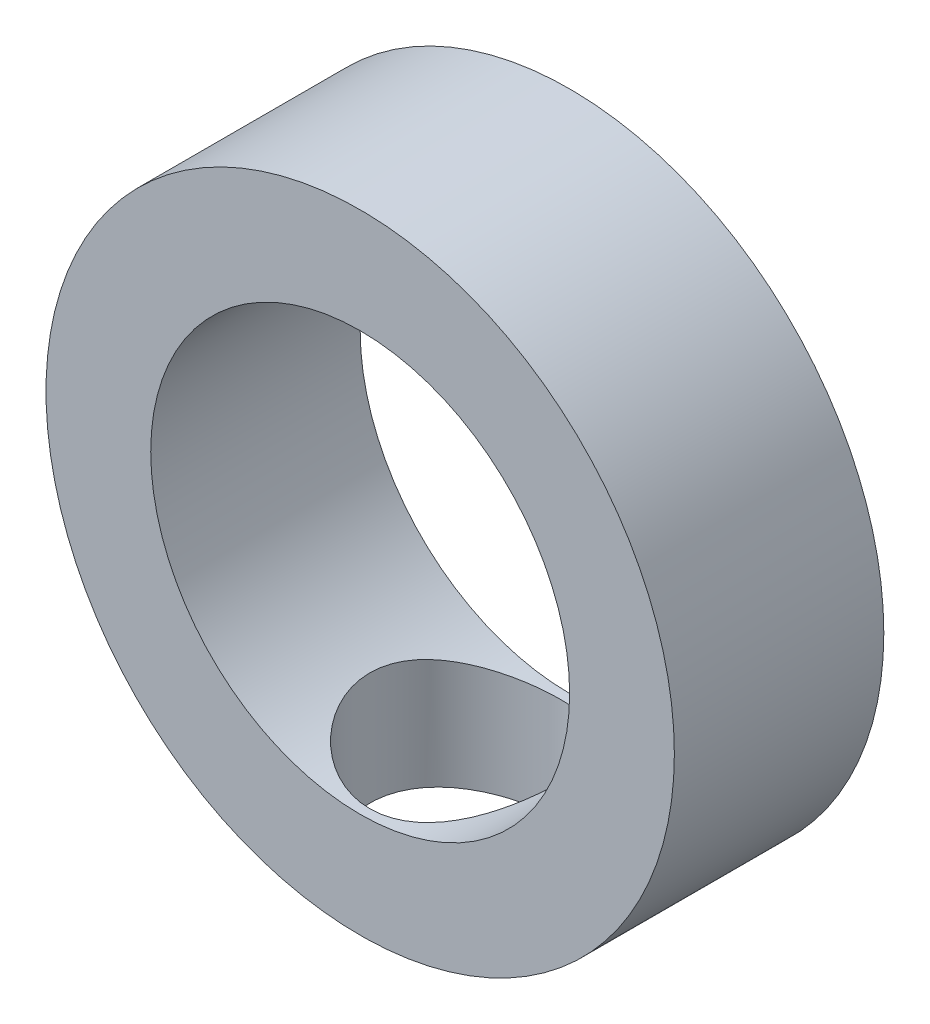
ISO-10303-21;
HEADER;
FILE_DESCRIPTION(('STEP AP214'),'2;1');
FILE_NAME('part.step','',(''),(''),'','','');
FILE_SCHEMA(('AUTOMOTIVE_DESIGN { 1 0 10303 214 1 1 1 1 }'));
ENDSEC;
DATA;
#1=APPLICATION_CONTEXT('core data for automotive mechanical design processes');
#2=APPLICATION_PROTOCOL_DEFINITION('international standard','automotive_design',2000,#1);
#3=PRODUCT_CONTEXT('',#1,'mechanical');
#4=PRODUCT('Part','Part','',(#3));
#5=PRODUCT_RELATED_PRODUCT_CATEGORY('part','',(#4));
#6=PRODUCT_DEFINITION_FORMATION('','',#4);
#7=PRODUCT_DEFINITION_CONTEXT('part definition',#1,'design');
#8=PRODUCT_DEFINITION('design','',#6,#7);
#9=PRODUCT_DEFINITION_SHAPE('','',#8);
#10=(LENGTH_UNIT() NAMED_UNIT(*) SI_UNIT(.MILLI.,.METRE.));
#11=(NAMED_UNIT(*) PLANE_ANGLE_UNIT() SI_UNIT($,.RADIAN.));
#12=(NAMED_UNIT(*) SI_UNIT($,.STERADIAN.) SOLID_ANGLE_UNIT());
#13=UNCERTAINTY_MEASURE_WITH_UNIT(LENGTH_MEASURE(1.E-05),#10,'distance_accuracy_value','');
#14=(GEOMETRIC_REPRESENTATION_CONTEXT(3) GLOBAL_UNCERTAINTY_ASSIGNED_CONTEXT((#13)) GLOBAL_UNIT_ASSIGNED_CONTEXT((#10,
#11,#12)) REPRESENTATION_CONTEXT('',''));
#15=CARTESIAN_POINT('',(0.,0.,0.));
#16=DIRECTION('',(0.,0.,1.));
#17=DIRECTION('',(1.,0.,0.));
#18=AXIS2_PLACEMENT_3D('',#15,#16,#17);
#19=CARTESIAN_POINT('',(0.,0.,2.5));
#20=DIRECTION('',(0.,0.,1.));
#21=DIRECTION('',(1.,0.,0.));
#22=AXIS2_PLACEMENT_3D('',#19,#20,#21);
#23=PLANE('',#22);
#24=CARTESIAN_POINT('',(0.,0.,2.5));
#25=DIRECTION('',(0.,0.,1.));
#26=DIRECTION('',(1.,0.,0.));
#27=AXIS2_PLACEMENT_3D('',#24,#25,#26);
#28=CIRCLE('',#27,7.5);
#29=CARTESIAN_POINT('',(7.5,0.,2.5));
#30=VERTEX_POINT('',#29);
#31=EDGE_CURVE('E10',#30,#30,#28,.T.);
#32=ORIENTED_EDGE('',*,*,#31,.T.);
#33=EDGE_LOOP('',(#32));
#34=FACE_BOUND('',#33,.T.);
#35=CARTESIAN_POINT('',(0.,0.,2.5));
#36=DIRECTION('',(0.,0.,1.));
#37=DIRECTION('',(1.,0.,0.));
#38=AXIS2_PLACEMENT_3D('',#35,#36,#37);
#39=CIRCLE('',#38,5.);
#40=CARTESIAN_POINT('',(5.,0.,2.5));
#41=VERTEX_POINT('',#40);
#42=EDGE_CURVE('E49',#41,#41,#39,.T.);
#43=ORIENTED_EDGE('',*,*,#42,.F.);
#44=EDGE_LOOP('',(#43));
#45=FACE_BOUND('',#44,.T.);
#46=ADVANCED_FACE('F31',(#34,#45),#23,.T.);
#47=CARTESIAN_POINT('',(0.,0.,-2.5));
#48=DIRECTION('',(0.,0.,1.));
#49=DIRECTION('',(1.,0.,0.));
#50=AXIS2_PLACEMENT_3D('',#47,#48,#49);
#51=PLANE('',#50);
#52=CARTESIAN_POINT('',(0.,0.,-2.5));
#53=DIRECTION('',(0.,0.,1.));
#54=DIRECTION('',(1.,0.,0.));
#55=AXIS2_PLACEMENT_3D('',#52,#53,#54);
#56=CIRCLE('',#55,7.5);
#57=CARTESIAN_POINT('',(7.5,0.,-2.5));
#58=VERTEX_POINT('',#57);
#59=EDGE_CURVE('E44',#58,#58,#56,.T.);
#60=ORIENTED_EDGE('',*,*,#59,.F.);
#61=EDGE_LOOP('',(#60));
#62=FACE_BOUND('',#61,.T.);
#63=CARTESIAN_POINT('',(0.,0.,-2.5));
#64=DIRECTION('',(0.,0.,1.));
#65=DIRECTION('',(1.,0.,0.));
#66=AXIS2_PLACEMENT_3D('',#63,#64,#65);
#67=CIRCLE('',#66,5.);
#68=CARTESIAN_POINT('',(5.,0.,-2.5));
#69=VERTEX_POINT('',#68);
#70=EDGE_CURVE('E51',#69,#69,#67,.T.);
#71=ORIENTED_EDGE('',*,*,#70,.T.);
#72=EDGE_LOOP('',(#71));
#73=FACE_BOUND('',#72,.T.);
#74=ADVANCED_FACE('F71',(#62,#73),#51,.F.);
#75=CARTESIAN_POINT('',(0.,0.,2.5));
#76=DIRECTION('',(0.,0.,-1.));
#77=DIRECTION('',(-1.,0.,0.));
#78=AXIS2_PLACEMENT_3D('',#75,#76,#77);
#79=CYLINDRICAL_SURFACE('',#78,7.5);
#80=CARTESIAN_POINT('',(0.,-7.5,2.26811205778749));
#81=CARTESIAN_POINT('',(0.124380004930475,-7.49999901041515,2.26811067724368));
#82=CARTESIAN_POINT('',(0.248773988035692,-7.49687641640472,2.25784694602173));
#83=CARTESIAN_POINT('',(0.493936565164761,-7.48472500152446,2.21716258089404));
#84=CARTESIAN_POINT('',(0.614704117592835,-7.47569450041953,2.18673621261265));
#85=CARTESIAN_POINT('',(0.849042458789456,-7.45271619716183,2.10683749830382));
#86=CARTESIAN_POINT('',(0.96262367334206,-7.43877572066525,2.05739351639013));
#87=CARTESIAN_POINT('',(1.17988336839848,-7.40742458721708,1.94098025364479));
#88=CARTESIAN_POINT('',(1.28356048160727,-7.39001345215039,1.87400855781128));
#89=CARTESIAN_POINT('',(1.48108880580503,-7.35300936013908,1.72238601435286));
#90=CARTESIAN_POINT('',(1.57461087456282,-7.33337114664256,1.63731744793528));
#91=CARTESIAN_POINT('',(1.74630252915413,-7.29439471733739,1.45280607597676));
#92=CARTESIAN_POINT('',(1.82446948063728,-7.27505655352901,1.35336080901573));
#93=CARTESIAN_POINT('',(1.96497407505311,-7.23838965945228,1.14012166510255));
#94=CARTESIAN_POINT('',(2.02690817858401,-7.22111709479673,1.02605132646176));
#95=CARTESIAN_POINT('',(2.13057959645331,-7.19121427167133,0.788507747324202));
#96=CARTESIAN_POINT('',(2.17232184955576,-7.17858287819029,0.665036814697097));
#97=CARTESIAN_POINT('',(2.23323445042042,-7.15986452542452,0.415896412290484));
#98=CARTESIAN_POINT('',(2.25301231936997,-7.15360184986758,0.290389034587983));
#99=CARTESIAN_POINT('',(2.27133196490298,-7.14780747904947,0.0376933151395118));
#100=CARTESIAN_POINT('',(2.26987898075043,-7.14827412315366,-0.0894946041490266));
#101=CARTESIAN_POINT('',(2.24625496268578,-7.15573005300162,-0.336984528794339));
#102=CARTESIAN_POINT('',(2.22484716131555,-7.16247903862855,-0.457367830218175));
#103=CARTESIAN_POINT('',(2.16315515797057,-7.18135014603121,-0.69274732642497));
#104=CARTESIAN_POINT('',(2.12286906588669,-7.19347280581679,-0.807742980524096));
#105=CARTESIAN_POINT('',(2.0240063132028,-7.221915662231,-1.03094044728983));
#106=CARTESIAN_POINT('',(1.96518362275285,-7.23829176676192,-1.13902585467056));
#107=CARTESIAN_POINT('',(1.83108840845483,-7.27336970468524,-1.34404641483145));
#108=CARTESIAN_POINT('',(1.75581184280405,-7.29207210903293,-1.4409788189927));
#109=CARTESIAN_POINT('',(1.58716377684879,-7.33066790777966,-1.62526805548175));
#110=CARTESIAN_POINT('',(1.4931595242417,-7.35057814873072,-1.71204332014049));
#111=CARTESIAN_POINT('',(1.29168534337727,-7.38864296578136,-1.86873428955071));
#112=CARTESIAN_POINT('',(1.18421454069327,-7.40679742773677,-1.93864889862231));
#113=CARTESIAN_POINT('',(0.957788848566871,-7.4394755675919,-2.05999479660368));
#114=CARTESIAN_POINT('',(0.838759836457604,-7.45397332907636,-2.1112952236166));
#115=CARTESIAN_POINT('',(0.593222840554135,-7.4775177428404,-2.192976473881));
#116=CARTESIAN_POINT('',(0.466716988939652,-7.48656594102085,-2.2233632301521));
#117=CARTESIAN_POINT('',(0.214759954891069,-7.49794642226515,-2.26138208118701));
#118=CARTESIAN_POINT('',(0.0894380037513087,-7.50051118063919,-2.26980219965653));
#119=CARTESIAN_POINT('',(-0.160837338140375,-7.49931888962388,-2.26585997504231));
#120=CARTESIAN_POINT('',(-0.28579077665686,-7.495562699165,-2.25350045562723));
#121=CARTESIAN_POINT('',(-0.528795427503979,-7.48230285508875,-2.20898612528323));
#122=CARTESIAN_POINT('',(-0.646939304213192,-7.47293344970557,-2.17729338349871));
#123=CARTESIAN_POINT('',(-0.87620560810731,-7.44953382554522,-2.09556968522993));
#124=CARTESIAN_POINT('',(-0.987327184558507,-7.43550304333762,-2.04553651182346));
#125=CARTESIAN_POINT('',(-1.20228139193923,-7.40382379716507,-1.92723980070054));
#126=CARTESIAN_POINT('',(-1.30588286893159,-7.38609842216896,-1.85857739071457));
#127=CARTESIAN_POINT('',(-1.50036084927829,-7.3490634773041,-1.70545479552696));
#128=CARTESIAN_POINT('',(-1.59123410226022,-7.32975350477021,-1.62099058787791));
#129=CARTESIAN_POINT('',(-1.76115659406094,-7.29083087061121,-1.43495875975379));
#130=CARTESIAN_POINT('',(-1.8396449727815,-7.2712333821074,-1.33287454988676));
#131=CARTESIAN_POINT('',(-1.97841849502096,-7.23470992945721,-1.11655815641791));
#132=CARTESIAN_POINT('',(-2.03870408351226,-7.21778390001109,-1.00232626986184));
#133=CARTESIAN_POINT('',(-2.13895472993321,-7.18871347911231,-0.765298256728712));
#134=CARTESIAN_POINT('',(-2.17901170352837,-7.17654751654314,-0.642543805101654));
#135=CARTESIAN_POINT('',(-2.23776177839687,-7.15844854192437,-0.391594118406677));
#136=CARTESIAN_POINT('',(-2.25646235213197,-7.15251334982851,-0.263400802653861));
#137=CARTESIAN_POINT('',(-2.27145524289557,-7.14776506684136,-0.0110457429445238));
#138=CARTESIAN_POINT('',(-2.26866293174287,-7.14866102464341,0.113056846033232));
#139=CARTESIAN_POINT('',(-2.24293902487034,-7.1567731800712,0.358935751266633));
#140=CARTESIAN_POINT('',(-2.22000826013822,-7.163989116911,0.480712163297166));
#141=CARTESIAN_POINT('',(-2.15525351786625,-7.18373143304585,0.716958875505766));
#142=CARTESIAN_POINT('',(-2.11367563158447,-7.1961885150466,0.831502849743113));
#143=CARTESIAN_POINT('',(-2.01299885127201,-7.22499582323834,1.05208068755578));
#144=CARTESIAN_POINT('',(-1.95389656223947,-7.24134680367319,1.1581128970847));
#145=CARTESIAN_POINT('',(-1.81729228041191,-7.27685350609402,1.36289560143759));
#146=CARTESIAN_POINT('',(-1.73919116790206,-7.29609053277952,1.46123233209248));
#147=CARTESIAN_POINT('',(-1.56788001142981,-7.33481101867799,1.64370074998133));
#148=CARTESIAN_POINT('',(-1.47466602499489,-7.35429454096783,1.72782871887339));
#149=CARTESIAN_POINT('',(-1.27242181997593,-7.39201064328956,1.88199833367906));
#150=CARTESIAN_POINT('',(-1.16300229570764,-7.41018846426812,1.95154408253592));
#151=CARTESIAN_POINT('',(-0.933474145925214,-7.44258186884047,2.07115597717286));
#152=CARTESIAN_POINT('',(-0.813370400840756,-7.45679924938096,2.12123096140118));
#153=CARTESIAN_POINT('',(-0.578646206696805,-7.47847612901315,2.19615202850127));
#154=CARTESIAN_POINT('',(-0.464732067111516,-7.48648024200108,2.22306304482311));
#155=CARTESIAN_POINT('',(-0.233882385716434,-7.49724218767874,2.25904216086376));
#156=CARTESIAN_POINT('',(-0.116947371603063,-7.50000093044978,2.26811335583351));
#157=CARTESIAN_POINT('',(0.,-7.5,2.26811205778749));
#158=B_SPLINE_CURVE_WITH_KNOTS('',3,(#80,#81,#82,#83,#84,#85,#86,#87,#88,#89,#90,#91,#92,#93,
#94,#95,#96,#97,#98,#99,#100,#101,#102,#103,#104,#105,#106,#107,#108,#109,#110,#111,#112,#113,
#114,#115,#116,#117,#118,#119,#120,#121,#122,#123,#124,#125,#126,#127,#128,#129,#130,#131,#132,
#133,#134,#135,#136,#137,#138,#139,#140,#141,#142,#143,#144,#145,#146,#147,#148,#149,#150,#151,
#152,#153,#154,#155,#156,#157),.UNSPECIFIED.,.T.,.F.,(4,2,2,2,2,2,2,2,2,2,2,2,2,2,2,2,2,2,2,2,2,
2,2,2,2,2,2,2,2,2,2,2,2,2,2,2,2,2,4),(0.,0.372710386147254,0.745526818896941,1.11778935156368,
1.49010320229913,1.87218473856597,2.25433176826009,2.64523108137395,3.03603473525739,
3.41573672715576,3.79534501931647,4.16100486013798,4.52670131893121,4.89747189943944,
5.26833366023471,5.65494708758687,6.04158563202136,6.43089194967331,6.82008777906267,
7.1951165910828,7.57009444593396,7.936443404555,8.30283666066691,8.67779609208548,
9.05285110199032,9.44176223581698,9.83066386183024,10.2177821108498,10.6047648682387,
10.9753603544638,11.3459405492557,11.7117677841261,12.0776659370493,12.4570825446928,
12.8365982898995,13.2274517231063,13.6181275268197,13.9686265042653,14.3190646639474),.UNSPECIFIED.);
#159=CARTESIAN_POINT('',(0.,-7.5,2.26811205778749));
#160=VERTEX_POINT('',#159);
#161=EDGE_CURVE('E54',#160,#160,#158,.T.);
#162=ORIENTED_EDGE('',*,*,#161,.T.);
#163=EDGE_LOOP('',(#162));
#164=FACE_BOUND('',#163,.T.);
#165=ORIENTED_EDGE('',*,*,#31,.F.);
#166=EDGE_LOOP('',(#165));
#167=FACE_BOUND('',#166,.T.);
#168=ORIENTED_EDGE('',*,*,#59,.T.);
#169=EDGE_LOOP('',(#168));
#170=FACE_BOUND('',#169,.T.);
#171=ADVANCED_FACE('F33',(#164,#167,#170),#79,.T.);
#172=CARTESIAN_POINT('',(0.,0.,2.5));
#173=DIRECTION('',(0.,0.,-1.));
#174=DIRECTION('',(-1.,0.,0.));
#175=AXIS2_PLACEMENT_3D('',#172,#173,#174);
#176=CYLINDRICAL_SURFACE('',#175,5.);
#177=CARTESIAN_POINT('',(0.,-5.,2.26811205778749));
#178=CARTESIAN_POINT('',(0.120523704172125,-4.99999499310897,2.26810600729395));
#179=CARTESIAN_POINT('',(0.241228849503654,-4.99559379700668,2.25844882201303));
#180=CARTESIAN_POINT('',(0.479151865196021,-4.9784250477364,2.22020958073332));
#181=CARTESIAN_POINT('',(0.596360952966409,-4.96563802084471,2.19158347315275));
#182=CARTESIAN_POINT('',(0.823474943623035,-4.93305210421924,2.11671032689937));
#183=CARTESIAN_POINT('',(0.933404644551615,-4.91327864711228,2.07052715530363));
#184=CARTESIAN_POINT('',(1.1438290984128,-4.86859744957126,1.96214307649859));
#185=CARTESIAN_POINT('',(1.24432576123287,-4.84369075173137,1.89994542129529));
#186=CARTESIAN_POINT('',(1.43896671832475,-4.78958326577251,1.75755490339453));
#187=CARTESIAN_POINT('',(1.53250195012128,-4.76022582935118,1.67658969587827));
#188=CARTESIAN_POINT('',(1.70520739062,-4.70112916056372,1.50060520948669));
#189=CARTESIAN_POINT('',(1.78436867705354,-4.6713897032462,1.40557726748274));
#190=CARTESIAN_POINT('',(1.93086407446079,-4.61284791275904,1.1971962973062));
#191=CARTESIAN_POINT('',(1.99718739329861,-4.58421229524369,1.08308068196662));
#192=CARTESIAN_POINT('',(2.10942840014669,-4.53366611420789,0.843843287150849));
#193=CARTESIAN_POINT('',(2.15535846401477,-4.51175147449691,0.718728238180692));
#194=CARTESIAN_POINT('',(2.22288150148131,-4.47885568950013,0.46803069552101));
#195=CARTESIAN_POINT('',(2.24565450129011,-4.46734814674558,0.342838102881679));
#196=CARTESIAN_POINT('',(2.26987961735366,-4.45509275212503,0.0899215146954593));
#197=CARTESIAN_POINT('',(2.27134690907774,-4.4543372418899,-0.0378006141938564));
#198=CARTESIAN_POINT('',(2.25379634945305,-4.46323446586439,-0.27928893049714));
#199=CARTESIAN_POINT('',(2.23669233077956,-4.4719148941295,-0.393237829007645));
#200=CARTESIAN_POINT('',(2.18573967755423,-4.49703683746277,-0.616427640824497));
#201=CARTESIAN_POINT('',(2.15188706866298,-4.51348019458468,-0.725667429995705));
#202=CARTESIAN_POINT('',(2.06772874348715,-4.55265695385768,-0.939318662334132));
#203=CARTESIAN_POINT('',(2.01706640622852,-4.5755248822385,-1.04356383151711));
#204=CARTESIAN_POINT('',(1.90098518690765,-4.62495726319232,-1.24252473866012));
#205=CARTESIAN_POINT('',(1.83555998488794,-4.65152329704661,-1.33723637014317));
#206=CARTESIAN_POINT('',(1.68400368500459,-4.7086439454006,-1.52460508578562));
#207=CARTESIAN_POINT('',(1.59644177147621,-4.73932909951705,-1.61606868284934));
#208=CARTESIAN_POINT('',(1.40698317120057,-4.79898514432605,-1.78345596669879));
#209=CARTESIAN_POINT('',(1.30508180675404,-4.82795547122297,-1.85937456260025));
#210=CARTESIAN_POINT('',(1.08563346052655,-4.88206470814452,-1.99572924977085));
#211=CARTESIAN_POINT('',(0.967690656608032,-4.90705165267407,-2.05559325318405));
#212=CARTESIAN_POINT('',(0.72198359023647,-4.94916471056948,-2.15419655195132));
#213=CARTESIAN_POINT('',(0.594225842539469,-4.96629598646287,-2.19294972391528));
#214=CARTESIAN_POINT('',(0.342410704715801,-4.98974741555599,-2.24553348340949));
#215=CARTESIAN_POINT('',(0.218751187839686,-4.99675829652007,-2.26096023263133));
#216=CARTESIAN_POINT('',(-0.0295817427454903,-5.00145229016117,-2.2713177992081));
#217=CARTESIAN_POINT('',(-0.154254776506283,-4.99913875078894,-2.26625597302198));
#218=CARTESIAN_POINT('',(-0.393022680547678,-4.98587705475625,-2.23683985507285));
#219=CARTESIAN_POINT('',(-0.507298536079755,-4.97546493756172,-2.21368284447518));
#220=CARTESIAN_POINT('',(-0.730173580533101,-4.94767281032761,-2.15048855325214));
#221=CARTESIAN_POINT('',(-0.838772088082781,-4.93029196609074,-2.1104492516884));
#222=CARTESIAN_POINT('',(-1.05104868615312,-4.88951398559943,-2.01337418642385));
#223=CARTESIAN_POINT('',(-1.15446936317674,-4.86594682813681,-1.95584936610448));
#224=CARTESIAN_POINT('',(-1.35056115344101,-4.81521127022441,-1.82596915800267));
#225=CARTESIAN_POINT('',(-1.44322752683241,-4.78804129308698,-1.75360726951563));
#226=CARTESIAN_POINT('',(-1.62335539977191,-4.7301584751148,-1.58907037141403));
#227=CARTESIAN_POINT('',(-1.70973425487551,-4.69933933474042,-1.49574476565323));
#228=CARTESIAN_POINT('',(-1.86598920892399,-4.63951507800666,-1.29558662673559));
#229=CARTESIAN_POINT('',(-1.93585865548093,-4.61051069634485,-1.1887486753737));
#230=CARTESIAN_POINT('',(-2.05875869024747,-4.55698821565875,-0.960756550972684));
#231=CARTESIAN_POINT('',(-2.11128347594714,-4.53261245462428,-0.839293634222701));
#232=CARTESIAN_POINT('',(-2.19461903649971,-4.49286279453585,-0.587777793854945));
#233=CARTESIAN_POINT('',(-2.22545220658735,-4.47747961398903,-0.457733881800714));
#234=CARTESIAN_POINT('',(-2.26212316186303,-4.45905612256302,-0.204935445605832));
#235=CARTESIAN_POINT('',(-2.26990403671658,-4.45505749777167,-0.0825325076122263));
#236=CARTESIAN_POINT('',(-2.26562712038748,-4.45723497504219,0.161819042477733));
#237=CARTESIAN_POINT('',(-2.25357406268807,-4.46340864942622,0.283767756016244));
#238=CARTESIAN_POINT('',(-2.2116937397412,-4.48429438322358,0.515464909427307));
#239=CARTESIAN_POINT('',(-2.18307691913613,-4.498423336848,0.625490335432953));
#240=CARTESIAN_POINT('',(-2.11019213723577,-4.53306827897032,0.839149566091797));
#241=CARTESIAN_POINT('',(-2.06591960087121,-4.55358613428715,0.94278149196451));
#242=CARTESIAN_POINT('',(-1.95969206348077,-4.60034540254628,1.14811150817946));
#243=CARTESIAN_POINT('',(-1.89677360849122,-4.62687245216891,1.24924457356803));
#244=CARTESIAN_POINT('',(-1.75626003633562,-4.68201282944867,1.44011862736187));
#245=CARTESIAN_POINT('',(-1.67865847564329,-4.71062706964693,1.52985458526326));
#246=CARTESIAN_POINT('',(-1.50249131733148,-4.76989777808608,1.7039874629147));
#247=CARTESIAN_POINT('',(-1.40264939904131,-4.80049776601546,1.78711897078378));
#248=CARTESIAN_POINT('',(-1.18938688328251,-4.85772918869789,1.93560545222529));
#249=CARTESIAN_POINT('',(-1.07596004009854,-4.8843587853221,2.00095220366635));
#250=CARTESIAN_POINT('',(-0.839437148537102,-4.93048990540822,2.11105268103773));
#251=CARTESIAN_POINT('',(-0.716437891312655,-4.95005375401244,2.15598741334835));
#252=CARTESIAN_POINT('',(-0.463700411654232,-4.98006579252072,2.22403579463722));
#253=CARTESIAN_POINT('',(-0.333983811824378,-4.99054151255296,2.24721536282809));
#254=CARTESIAN_POINT('',(-0.169486096428793,-4.99724268195269,2.26202705181321));
#255=CARTESIAN_POINT('',(-0.135641630289338,-4.99827478791384,2.264306665155));
#256=CARTESIAN_POINT('',(-0.0678695736452886,-4.99965415711592,2.26735003152728));
#257=CARTESIAN_POINT('',(-0.0339419818967293,-5.00000141004465,2.26811376173232));
#258=CARTESIAN_POINT('',(0.,-5.,2.26811205778749));
#259=B_SPLINE_CURVE_WITH_KNOTS('',3,(#177,#178,#179,#180,#181,#182,#183,#184,#185,#186,#187,
#188,#189,#190,#191,#192,#193,#194,#195,#196,#197,#198,#199,#200,#201,#202,#203,#204,#205,#206,
#207,#208,#209,#210,#211,#212,#213,#214,#215,#216,#217,#218,#219,#220,#221,#222,#223,#224,#225,
#226,#227,#228,#229,#230,#231,#232,#233,#234,#235,#236,#237,#238,#239,#240,#241,#242,#243,#244,
#245,#246,#247,#248,#249,#250,#251,#252,#253,#254,#255,#256,#257,#258),.UNSPECIFIED.,.T.,.F.,(4,
2,2,2,2,2,2,2,2,2,2,2,2,2,2,2,2,2,2,2,2,2,2,2,2,2,2,2,2,2,2,2,2,2,2,2,2,2,2,2,4),(0.,
0.361431928048513,0.723706165949312,1.08467498245302,1.44557055599472,1.8253825855178,
2.2054295739129,2.60856692532802,3.01145929316737,3.39260055883896,3.77347033475211,
4.11851584511364,4.46364327199158,4.81661849743439,5.16974511862946,5.55886658580785,
5.94811528456826,6.34979902322344,6.75121840681791,7.12368095517669,7.49600978206882,
7.84559652341953,8.1952251248432,8.55570772961015,8.91634861481894,9.30713690726899,
9.69808239850115,10.0995875623034,10.500677586404,10.8668346169614,11.2329042746889,
11.5750999789843,11.9173957658699,12.2819736576643,12.6467119132618,13.0452507142867,
13.4439734533636,13.8390879249893,14.2330012781778,14.3347864940053,14.4365732424544),.UNSPECIFIED.);
#260=CARTESIAN_POINT('',(0.,-5.,2.26811205778749));
#261=VERTEX_POINT('',#260);
#262=EDGE_CURVE('E36',#261,#261,#259,.T.);
#263=ORIENTED_EDGE('',*,*,#262,.F.);
#264=EDGE_LOOP('',(#263));
#265=FACE_BOUND('',#264,.T.);
#266=ORIENTED_EDGE('',*,*,#42,.T.);
#267=EDGE_LOOP('',(#266));
#268=FACE_BOUND('',#267,.T.);
#269=ORIENTED_EDGE('',*,*,#70,.F.);
#270=EDGE_LOOP('',(#269));
#271=FACE_BOUND('',#270,.T.);
#272=ADVANCED_FACE('F63',(#265,#268,#271),#176,.F.);
#273=CARTESIAN_POINT('',(0.,-10.,0.));
#274=DIRECTION('',(0.,1.,0.));
#275=DIRECTION('',(0.,0.,1.));
#276=AXIS2_PLACEMENT_3D('',#273,#274,#275);
#277=CYLINDRICAL_SURFACE('',#276,2.26811205778749);
#278=ORIENTED_EDGE('',*,*,#262,.T.);
#279=EDGE_LOOP('',(#278));
#280=FACE_BOUND('',#279,.T.);
#281=ORIENTED_EDGE('',*,*,#161,.F.);
#282=EDGE_LOOP('',(#281));
#283=FACE_BOUND('',#282,.T.);
#284=ADVANCED_FACE('F60',(#280,#283),#277,.F.);
#285=CLOSED_SHELL('',(#46,#74,#171,#272,#284));
#286=MANIFOLD_SOLID_BREP('B2',#285);
#287=ADVANCED_BREP_SHAPE_REPRESENTATION('',(#18,#286),#14);
#288=SHAPE_DEFINITION_REPRESENTATION(#9,#287);
ENDSEC;
END-ISO-10303-21;
